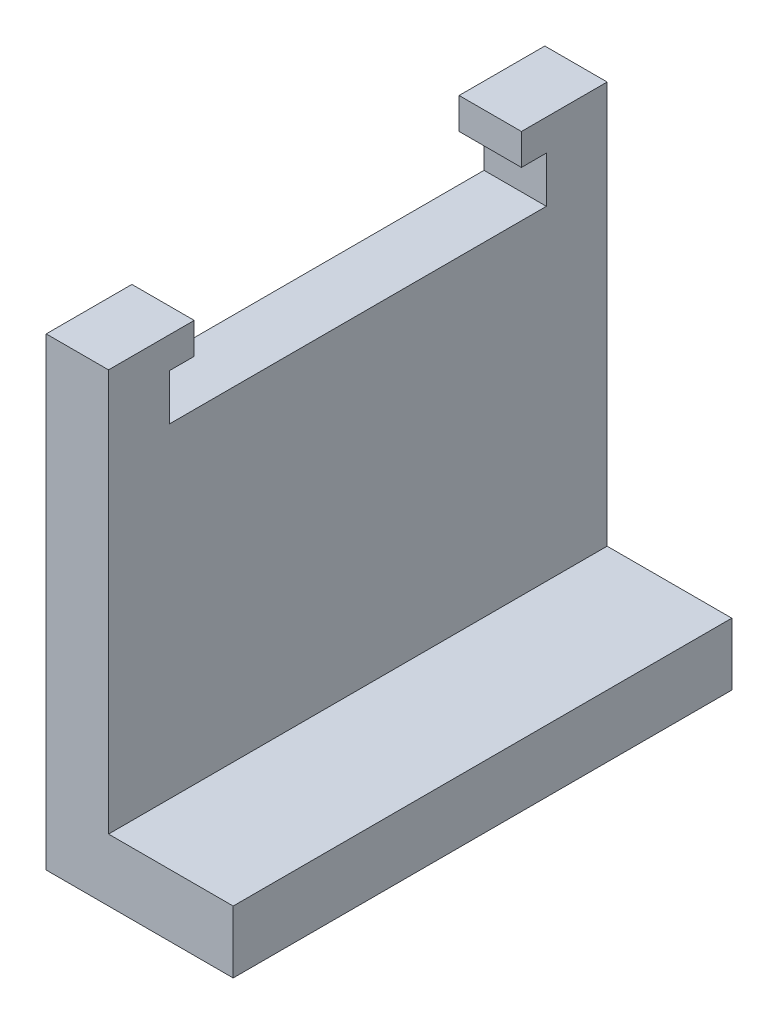
ISO-10303-21;
HEADER;
FILE_DESCRIPTION(('STEP AP214'),'2;1');
FILE_NAME('part.step','',(''),(''),'','','');
FILE_SCHEMA(('AUTOMOTIVE_DESIGN { 1 0 10303 214 1 1 1 1 }'));
ENDSEC;
DATA;
#1=APPLICATION_CONTEXT('core data for automotive mechanical design processes');
#2=APPLICATION_PROTOCOL_DEFINITION('international standard','automotive_design',2000,#1);
#3=PRODUCT_CONTEXT('',#1,'mechanical');
#4=PRODUCT('Part','Part','',(#3));
#5=PRODUCT_RELATED_PRODUCT_CATEGORY('part','',(#4));
#6=PRODUCT_DEFINITION_FORMATION('','',#4);
#7=PRODUCT_DEFINITION_CONTEXT('part definition',#1,'design');
#8=PRODUCT_DEFINITION('design','',#6,#7);
#9=PRODUCT_DEFINITION_SHAPE('','',#8);
#10=(LENGTH_UNIT() NAMED_UNIT(*) SI_UNIT(.MILLI.,.METRE.));
#11=(NAMED_UNIT(*) PLANE_ANGLE_UNIT() SI_UNIT($,.RADIAN.));
#12=(NAMED_UNIT(*) SI_UNIT($,.STERADIAN.) SOLID_ANGLE_UNIT());
#13=UNCERTAINTY_MEASURE_WITH_UNIT(LENGTH_MEASURE(1.E-05),#10,'distance_accuracy_value','');
#14=(GEOMETRIC_REPRESENTATION_CONTEXT(3) GLOBAL_UNCERTAINTY_ASSIGNED_CONTEXT((#13)) GLOBAL_UNIT_ASSIGNED_CONTEXT((#10,
#11,#12)) REPRESENTATION_CONTEXT('',''));
#15=CARTESIAN_POINT('',(0.,0.,0.));
#16=DIRECTION('',(0.,0.,1.));
#17=DIRECTION('',(1.,0.,0.));
#18=AXIS2_PLACEMENT_3D('',#15,#16,#17);
#19=CARTESIAN_POINT('',(10.,74.5,0.));
#20=DIRECTION('',(0.,0.,-1.));
#21=DIRECTION('',(-1.,0.,0.));
#22=AXIS2_PLACEMENT_3D('',#19,#20,#21);
#23=PLANE('',#22);
#24=DIRECTION('',(0.,-1.,0.));
#25=VECTOR('',#24,1.);
#26=CARTESIAN_POINT('',(0.,74.5,0.));
#27=LINE('',#26,#25);
#28=CARTESIAN_POINT('',(0.,74.5,0.));
#29=VERTEX_POINT('',#28);
#30=CARTESIAN_POINT('',(0.,0.,0.));
#31=VERTEX_POINT('',#30);
#32=EDGE_CURVE('E157',#29,#31,#27,.T.);
#33=ORIENTED_EDGE('',*,*,#32,.T.);
#34=DIRECTION('',(-1.,0.,0.));
#35=VECTOR('',#34,1.);
#36=CARTESIAN_POINT('',(10.,0.,0.));
#37=LINE('',#36,#35);
#38=CARTESIAN_POINT('',(30.,0.,0.));
#39=VERTEX_POINT('',#38);
#40=EDGE_CURVE('E11',#39,#31,#37,.T.);
#41=ORIENTED_EDGE('',*,*,#40,.F.);
#42=DIRECTION('',(0.,-1.,0.));
#43=VECTOR('',#42,1.);
#44=CARTESIAN_POINT('',(30.,0.,0.));
#45=LINE('',#44,#43);
#46=CARTESIAN_POINT('',(30.,10.,0.));
#47=VERTEX_POINT('',#46);
#48=EDGE_CURVE('E265',#47,#39,#45,.T.);
#49=ORIENTED_EDGE('',*,*,#48,.F.);
#50=DIRECTION('',(-1.,0.,0.));
#51=VECTOR('',#50,1.);
#52=CARTESIAN_POINT('',(30.,10.,0.));
#53=LINE('',#52,#51);
#54=CARTESIAN_POINT('',(10.,10.,0.));
#55=VERTEX_POINT('',#54);
#56=EDGE_CURVE('E257',#47,#55,#53,.T.);
#57=ORIENTED_EDGE('',*,*,#56,.T.);
#58=DIRECTION('',(0.,-1.,0.));
#59=VECTOR('',#58,1.);
#60=CARTESIAN_POINT('',(10.,74.5,0.));
#61=LINE('',#60,#59);
#62=CARTESIAN_POINT('',(10.,74.5,0.));
#63=VERTEX_POINT('',#62);
#64=EDGE_CURVE('E181',#63,#55,#61,.T.);
#65=ORIENTED_EDGE('',*,*,#64,.F.);
#66=DIRECTION('',(-1.,0.,0.));
#67=VECTOR('',#66,1.);
#68=CARTESIAN_POINT('',(10.,74.5,0.));
#69=LINE('',#68,#67);
#70=EDGE_CURVE('E153',#63,#29,#69,.T.);
#71=ORIENTED_EDGE('',*,*,#70,.T.);
#72=EDGE_LOOP('',(#33,#41,#49,#57,#65,#71));
#73=FACE_BOUND('',#72,.T.);
#74=ADVANCED_FACE('F35',(#73),#23,.F.);
#75=CARTESIAN_POINT('',(10.,0.,0.));
#76=DIRECTION('',(0.,1.,0.));
#77=DIRECTION('',(0.,0.,1.));
#78=AXIS2_PLACEMENT_3D('',#75,#76,#77);
#79=PLANE('',#78);
#80=DIRECTION('',(0.,0.,-1.));
#81=VECTOR('',#80,1.);
#82=CARTESIAN_POINT('',(0.,0.,0.));
#83=LINE('',#82,#81);
#84=CARTESIAN_POINT('',(0.,0.,-80.));
#85=VERTEX_POINT('',#84);
#86=EDGE_CURVE('E160',#31,#85,#83,.T.);
#87=ORIENTED_EDGE('',*,*,#86,.T.);
#88=DIRECTION('',(-1.,0.,0.));
#89=VECTOR('',#88,1.);
#90=CARTESIAN_POINT('',(10.,0.,-80.));
#91=LINE('',#90,#89);
#92=CARTESIAN_POINT('',(30.,0.,-80.));
#93=VERTEX_POINT('',#92);
#94=EDGE_CURVE('E42',#93,#85,#91,.T.);
#95=ORIENTED_EDGE('',*,*,#94,.F.);
#96=DIRECTION('',(0.,0.,-1.));
#97=VECTOR('',#96,1.);
#98=CARTESIAN_POINT('',(30.,0.,0.));
#99=LINE('',#98,#97);
#100=EDGE_CURVE('E269',#39,#93,#99,.T.);
#101=ORIENTED_EDGE('',*,*,#100,.F.);
#102=ORIENTED_EDGE('',*,*,#40,.T.);
#103=EDGE_LOOP('',(#87,#95,#101,#102));
#104=FACE_BOUND('',#103,.T.);
#105=ADVANCED_FACE('F293',(#104),#79,.F.);
#106=CARTESIAN_POINT('',(10.,0.,-80.));
#107=DIRECTION('',(0.,0.,1.));
#108=DIRECTION('',(0.,-1.,0.));
#109=AXIS2_PLACEMENT_3D('',#106,#107,#108);
#110=PLANE('',#109);
#111=DIRECTION('',(0.,1.,0.));
#112=VECTOR('',#111,1.);
#113=CARTESIAN_POINT('',(0.,0.,-80.));
#114=LINE('',#113,#112);
#115=CARTESIAN_POINT('',(0.,74.5,-80.));
#116=VERTEX_POINT('',#115);
#117=EDGE_CURVE('E163',#85,#116,#114,.T.);
#118=ORIENTED_EDGE('',*,*,#117,.T.);
#119=DIRECTION('',(-1.,0.,0.));
#120=VECTOR('',#119,1.);
#121=CARTESIAN_POINT('',(10.,74.5,-80.));
#122=LINE('',#121,#120);
#123=CARTESIAN_POINT('',(10.,74.5,-80.));
#124=VERTEX_POINT('',#123);
#125=EDGE_CURVE('E200',#124,#116,#122,.T.);
#126=ORIENTED_EDGE('',*,*,#125,.F.);
#127=DIRECTION('',(0.,1.,0.));
#128=VECTOR('',#127,1.);
#129=CARTESIAN_POINT('',(10.,0.,-80.));
#130=LINE('',#129,#128);
#131=CARTESIAN_POINT('',(10.,10.,-80.));
#132=VERTEX_POINT('',#131);
#133=EDGE_CURVE('E106',#132,#124,#130,.T.);
#134=ORIENTED_EDGE('',*,*,#133,.F.);
#135=DIRECTION('',(-1.,0.,0.));
#136=VECTOR('',#135,1.);
#137=CARTESIAN_POINT('',(30.,10.,-80.));
#138=LINE('',#137,#136);
#139=CARTESIAN_POINT('',(30.,10.,-80.));
#140=VERTEX_POINT('',#139);
#141=EDGE_CURVE('E161',#140,#132,#138,.T.);
#142=ORIENTED_EDGE('',*,*,#141,.F.);
#143=DIRECTION('',(0.,1.,0.));
#144=VECTOR('',#143,1.);
#145=CARTESIAN_POINT('',(30.,0.,-80.));
#146=LINE('',#145,#144);
#147=EDGE_CURVE('E211',#93,#140,#146,.T.);
#148=ORIENTED_EDGE('',*,*,#147,.F.);
#149=ORIENTED_EDGE('',*,*,#94,.T.);
#150=EDGE_LOOP('',(#118,#126,#134,#142,#148,#149));
#151=FACE_BOUND('',#150,.T.);
#152=ADVANCED_FACE('F207',(#151),#110,.F.);
#153=CARTESIAN_POINT('',(10.,74.5,-80.));
#154=DIRECTION('',(0.,-1.,0.));
#155=DIRECTION('',(0.,0.,-1.));
#156=AXIS2_PLACEMENT_3D('',#153,#154,#155);
#157=PLANE('',#156);
#158=DIRECTION('',(0.,0.,1.));
#159=VECTOR('',#158,1.);
#160=CARTESIAN_POINT('',(0.,74.5,-80.));
#161=LINE('',#160,#159);
#162=CARTESIAN_POINT('',(0.,74.5,-66.25));
#163=VERTEX_POINT('',#162);
#164=EDGE_CURVE('E165',#116,#163,#161,.T.);
#165=ORIENTED_EDGE('',*,*,#164,.T.);
#166=DIRECTION('',(-1.,0.,0.));
#167=VECTOR('',#166,1.);
#168=CARTESIAN_POINT('',(10.,74.5,-66.25));
#169=LINE('',#168,#167);
#170=CARTESIAN_POINT('',(10.,74.5,-66.25));
#171=VERTEX_POINT('',#170);
#172=EDGE_CURVE('E197',#171,#163,#169,.T.);
#173=ORIENTED_EDGE('',*,*,#172,.F.);
#174=DIRECTION('',(0.,0.,1.));
#175=VECTOR('',#174,1.);
#176=CARTESIAN_POINT('',(10.,74.5,-80.));
#177=LINE('',#176,#175);
#178=EDGE_CURVE('E232',#124,#171,#177,.T.);
#179=ORIENTED_EDGE('',*,*,#178,.F.);
#180=ORIENTED_EDGE('',*,*,#125,.T.);
#181=EDGE_LOOP('',(#165,#173,#179,#180));
#182=FACE_BOUND('',#181,.T.);
#183=ADVANCED_FACE('F223',(#182),#157,.F.);
#184=CARTESIAN_POINT('',(10.,74.5,-66.25));
#185=DIRECTION('',(0.,0.,-1.));
#186=DIRECTION('',(-1.,0.,0.));
#187=AXIS2_PLACEMENT_3D('',#184,#185,#186);
#188=PLANE('',#187);
#189=DIRECTION('',(0.,-1.,0.));
#190=VECTOR('',#189,1.);
#191=CARTESIAN_POINT('',(0.,74.5,-66.25));
#192=LINE('',#191,#190);
#193=CARTESIAN_POINT('',(0.,69.5,-66.25));
#194=VERTEX_POINT('',#193);
#195=EDGE_CURVE('E167',#163,#194,#192,.T.);
#196=ORIENTED_EDGE('',*,*,#195,.T.);
#197=DIRECTION('',(-1.,0.,0.));
#198=VECTOR('',#197,1.);
#199=CARTESIAN_POINT('',(10.,69.5,-66.25));
#200=LINE('',#199,#198);
#201=CARTESIAN_POINT('',(10.,69.5,-66.25));
#202=VERTEX_POINT('',#201);
#203=EDGE_CURVE('E194',#202,#194,#200,.T.);
#204=ORIENTED_EDGE('',*,*,#203,.F.);
#205=DIRECTION('',(0.,-1.,0.));
#206=VECTOR('',#205,1.);
#207=CARTESIAN_POINT('',(10.,74.5,-66.25));
#208=LINE('',#207,#206);
#209=EDGE_CURVE('E229',#171,#202,#208,.T.);
#210=ORIENTED_EDGE('',*,*,#209,.F.);
#211=ORIENTED_EDGE('',*,*,#172,.T.);
#212=EDGE_LOOP('',(#196,#204,#210,#211));
#213=FACE_BOUND('',#212,.T.);
#214=ADVANCED_FACE('F227',(#213),#188,.F.);
#215=CARTESIAN_POINT('',(10.,69.5,-66.25));
#216=DIRECTION('',(0.,1.,0.));
#217=DIRECTION('',(0.,0.,1.));
#218=AXIS2_PLACEMENT_3D('',#215,#216,#217);
#219=PLANE('',#218);
#220=DIRECTION('',(0.,0.,-1.));
#221=VECTOR('',#220,1.);
#222=CARTESIAN_POINT('',(0.,69.5,-66.25));
#223=LINE('',#222,#221);
#224=CARTESIAN_POINT('',(0.,69.5,-70.25));
#225=VERTEX_POINT('',#224);
#226=EDGE_CURVE('E169',#194,#225,#223,.T.);
#227=ORIENTED_EDGE('',*,*,#226,.T.);
#228=DIRECTION('',(-1.,0.,0.));
#229=VECTOR('',#228,1.);
#230=CARTESIAN_POINT('',(10.,69.5,-70.25));
#231=LINE('',#230,#229);
#232=CARTESIAN_POINT('',(10.,69.5,-70.25));
#233=VERTEX_POINT('',#232);
#234=EDGE_CURVE('E191',#233,#225,#231,.T.);
#235=ORIENTED_EDGE('',*,*,#234,.F.);
#236=DIRECTION('',(0.,0.,-1.));
#237=VECTOR('',#236,1.);
#238=CARTESIAN_POINT('',(10.,69.5,-66.25));
#239=LINE('',#238,#237);
#240=EDGE_CURVE('E231',#202,#233,#239,.T.);
#241=ORIENTED_EDGE('',*,*,#240,.F.);
#242=ORIENTED_EDGE('',*,*,#203,.T.);
#243=EDGE_LOOP('',(#227,#235,#241,#242));
#244=FACE_BOUND('',#243,.T.);
#245=ADVANCED_FACE('F306',(#244),#219,.F.);
#246=CARTESIAN_POINT('',(10.,69.5,-70.25));
#247=DIRECTION('',(0.,0.,-1.));
#248=DIRECTION('',(-1.,0.,0.));
#249=AXIS2_PLACEMENT_3D('',#246,#247,#248);
#250=PLANE('',#249);
#251=DIRECTION('',(0.,-1.,0.));
#252=VECTOR('',#251,1.);
#253=CARTESIAN_POINT('',(0.,69.5,-70.25));
#254=LINE('',#253,#252);
#255=CARTESIAN_POINT('',(0.,62.1,-70.25));
#256=VERTEX_POINT('',#255);
#257=EDGE_CURVE('E171',#225,#256,#254,.T.);
#258=ORIENTED_EDGE('',*,*,#257,.T.);
#259=DIRECTION('',(-1.,0.,0.));
#260=VECTOR('',#259,1.);
#261=CARTESIAN_POINT('',(10.,62.1,-70.25));
#262=LINE('',#261,#260);
#263=CARTESIAN_POINT('',(10.,62.1,-70.25));
#264=VERTEX_POINT('',#263);
#265=EDGE_CURVE('E188',#264,#256,#262,.T.);
#266=ORIENTED_EDGE('',*,*,#265,.F.);
#267=DIRECTION('',(0.,-1.,0.));
#268=VECTOR('',#267,1.);
#269=CARTESIAN_POINT('',(10.,69.5,-70.25));
#270=LINE('',#269,#268);
#271=EDGE_CURVE('E234',#233,#264,#270,.T.);
#272=ORIENTED_EDGE('',*,*,#271,.F.);
#273=ORIENTED_EDGE('',*,*,#234,.T.);
#274=EDGE_LOOP('',(#258,#266,#272,#273));
#275=FACE_BOUND('',#274,.T.);
#276=ADVANCED_FACE('F309',(#275),#250,.F.);
#277=CARTESIAN_POINT('',(10.,62.1,-70.25));
#278=DIRECTION('',(0.,-1.,0.));
#279=DIRECTION('',(0.,0.,-1.));
#280=AXIS2_PLACEMENT_3D('',#277,#278,#279);
#281=PLANE('',#280);
#282=DIRECTION('',(0.,0.,1.));
#283=VECTOR('',#282,1.);
#284=CARTESIAN_POINT('',(0.,62.1,-70.25));
#285=LINE('',#284,#283);
#286=CARTESIAN_POINT('',(0.,62.1,-9.74999999999998));
#287=VERTEX_POINT('',#286);
#288=EDGE_CURVE('E173',#256,#287,#285,.T.);
#289=ORIENTED_EDGE('',*,*,#288,.T.);
#290=DIRECTION('',(-1.,0.,0.));
#291=VECTOR('',#290,1.);
#292=CARTESIAN_POINT('',(10.,62.1,-9.74999999999998));
#293=LINE('',#292,#291);
#294=CARTESIAN_POINT('',(10.,62.1,-9.74999999999998));
#295=VERTEX_POINT('',#294);
#296=EDGE_CURVE('E185',#295,#287,#293,.T.);
#297=ORIENTED_EDGE('',*,*,#296,.F.);
#298=DIRECTION('',(0.,0.,1.));
#299=VECTOR('',#298,1.);
#300=CARTESIAN_POINT('',(10.,62.1,-70.25));
#301=LINE('',#300,#299);
#302=EDGE_CURVE('E240',#264,#295,#301,.T.);
#303=ORIENTED_EDGE('',*,*,#302,.F.);
#304=ORIENTED_EDGE('',*,*,#265,.T.);
#305=EDGE_LOOP('',(#289,#297,#303,#304));
#306=FACE_BOUND('',#305,.T.);
#307=ADVANCED_FACE('F246',(#306),#281,.F.);
#308=CARTESIAN_POINT('',(10.,62.1,-9.74999999999998));
#309=DIRECTION('',(0.,0.,1.));
#310=DIRECTION('',(0.,-1.,0.));
#311=AXIS2_PLACEMENT_3D('',#308,#309,#310);
#312=PLANE('',#311);
#313=DIRECTION('',(0.,1.,0.));
#314=VECTOR('',#313,1.);
#315=CARTESIAN_POINT('',(0.,62.1,-9.74999999999998));
#316=LINE('',#315,#314);
#317=CARTESIAN_POINT('',(0.,69.5,-9.74999999999998));
#318=VERTEX_POINT('',#317);
#319=EDGE_CURVE('E175',#287,#318,#316,.T.);
#320=ORIENTED_EDGE('',*,*,#319,.T.);
#321=DIRECTION('',(-1.,0.,0.));
#322=VECTOR('',#321,1.);
#323=CARTESIAN_POINT('',(10.,69.5,-9.74999999999998));
#324=LINE('',#323,#322);
#325=CARTESIAN_POINT('',(10.,69.5,-9.74999999999998));
#326=VERTEX_POINT('',#325);
#327=EDGE_CURVE('E148',#326,#318,#324,.T.);
#328=ORIENTED_EDGE('',*,*,#327,.F.);
#329=DIRECTION('',(0.,1.,0.));
#330=VECTOR('',#329,1.);
#331=CARTESIAN_POINT('',(10.,62.1,-9.74999999999998));
#332=LINE('',#331,#330);
#333=EDGE_CURVE('E136',#295,#326,#332,.T.);
#334=ORIENTED_EDGE('',*,*,#333,.F.);
#335=ORIENTED_EDGE('',*,*,#296,.T.);
#336=EDGE_LOOP('',(#320,#328,#334,#335));
#337=FACE_BOUND('',#336,.T.);
#338=ADVANCED_FACE('F250',(#337),#312,.F.);
#339=CARTESIAN_POINT('',(10.,69.5,-9.74999999999998));
#340=DIRECTION('',(0.,1.,0.));
#341=DIRECTION('',(0.,0.,1.));
#342=AXIS2_PLACEMENT_3D('',#339,#340,#341);
#343=PLANE('',#342);
#344=DIRECTION('',(0.,0.,-1.));
#345=VECTOR('',#344,1.);
#346=CARTESIAN_POINT('',(0.,69.5,-9.74999999999998));
#347=LINE('',#346,#345);
#348=CARTESIAN_POINT('',(0.,69.5,-13.75));
#349=VERTEX_POINT('',#348);
#350=EDGE_CURVE('E145',#318,#349,#347,.T.);
#351=ORIENTED_EDGE('',*,*,#350,.T.);
#352=DIRECTION('',(-1.,0.,0.));
#353=VECTOR('',#352,1.);
#354=CARTESIAN_POINT('',(10.,69.5,-13.75));
#355=LINE('',#354,#353);
#356=CARTESIAN_POINT('',(10.,69.5,-13.75));
#357=VERTEX_POINT('',#356);
#358=EDGE_CURVE('E142',#357,#349,#355,.T.);
#359=ORIENTED_EDGE('',*,*,#358,.F.);
#360=DIRECTION('',(0.,0.,-1.));
#361=VECTOR('',#360,1.);
#362=CARTESIAN_POINT('',(10.,69.5,-9.74999999999998));
#363=LINE('',#362,#361);
#364=EDGE_CURVE('E129',#326,#357,#363,.T.);
#365=ORIENTED_EDGE('',*,*,#364,.F.);
#366=ORIENTED_EDGE('',*,*,#327,.T.);
#367=EDGE_LOOP('',(#351,#359,#365,#366));
#368=FACE_BOUND('',#367,.T.);
#369=ADVANCED_FACE('F143',(#368),#343,.F.);
#370=CARTESIAN_POINT('',(10.,69.5,-13.75));
#371=DIRECTION('',(0.,0.,1.));
#372=DIRECTION('',(1.,0.,0.));
#373=AXIS2_PLACEMENT_3D('',#370,#371,#372);
#374=PLANE('',#373);
#375=DIRECTION('',(0.,1.,0.));
#376=VECTOR('',#375,1.);
#377=CARTESIAN_POINT('',(0.,69.5,-13.75));
#378=LINE('',#377,#376);
#379=CARTESIAN_POINT('',(0.,74.5,-13.75));
#380=VERTEX_POINT('',#379);
#381=EDGE_CURVE('E178',#349,#380,#378,.T.);
#382=ORIENTED_EDGE('',*,*,#381,.T.);
#383=DIRECTION('',(-1.,0.,0.));
#384=VECTOR('',#383,1.);
#385=CARTESIAN_POINT('',(10.,74.5,-13.75));
#386=LINE('',#385,#384);
#387=CARTESIAN_POINT('',(10.,74.5,-13.75));
#388=VERTEX_POINT('',#387);
#389=EDGE_CURVE('E149',#388,#380,#386,.T.);
#390=ORIENTED_EDGE('',*,*,#389,.F.);
#391=DIRECTION('',(0.,1.,0.));
#392=VECTOR('',#391,1.);
#393=CARTESIAN_POINT('',(10.,69.5,-13.75));
#394=LINE('',#393,#392);
#395=EDGE_CURVE('E133',#357,#388,#394,.T.);
#396=ORIENTED_EDGE('',*,*,#395,.F.);
#397=ORIENTED_EDGE('',*,*,#358,.T.);
#398=EDGE_LOOP('',(#382,#390,#396,#397));
#399=FACE_BOUND('',#398,.T.);
#400=ADVANCED_FACE('F151',(#399),#374,.F.);
#401=CARTESIAN_POINT('',(10.,74.5,-13.75));
#402=DIRECTION('',(0.,-1.,0.));
#403=DIRECTION('',(0.,0.,-1.));
#404=AXIS2_PLACEMENT_3D('',#401,#402,#403);
#405=PLANE('',#404);
#406=DIRECTION('',(0.,0.,1.));
#407=VECTOR('',#406,1.);
#408=CARTESIAN_POINT('',(0.,74.5,-13.75));
#409=LINE('',#408,#407);
#410=EDGE_CURVE('E101',#380,#29,#409,.T.);
#411=ORIENTED_EDGE('',*,*,#410,.T.);
#412=ORIENTED_EDGE('',*,*,#70,.F.);
#413=DIRECTION('',(0.,0.,1.));
#414=VECTOR('',#413,1.);
#415=CARTESIAN_POINT('',(10.,74.5,-13.75));
#416=LINE('',#415,#414);
#417=EDGE_CURVE('E56',#388,#63,#416,.T.);
#418=ORIENTED_EDGE('',*,*,#417,.F.);
#419=ORIENTED_EDGE('',*,*,#389,.T.);
#420=EDGE_LOOP('',(#411,#412,#418,#419));
#421=FACE_BOUND('',#420,.T.);
#422=ADVANCED_FACE('F251',(#421),#405,.F.);
#423=CARTESIAN_POINT('',(10.,0.,0.));
#424=DIRECTION('',(1.,0.,0.));
#425=DIRECTION('',(0.,0.,-1.));
#426=AXIS2_PLACEMENT_3D('',#423,#424,#425);
#427=PLANE('',#426);
#428=DIRECTION('',(0.,0.,1.));
#429=VECTOR('',#428,1.);
#430=CARTESIAN_POINT('',(10.,10.,0.));
#431=LINE('',#430,#429);
#432=EDGE_CURVE('E49',#132,#55,#431,.T.);
#433=ORIENTED_EDGE('',*,*,#432,.F.);
#434=ORIENTED_EDGE('',*,*,#133,.T.);
#435=ORIENTED_EDGE('',*,*,#178,.T.);
#436=ORIENTED_EDGE('',*,*,#209,.T.);
#437=ORIENTED_EDGE('',*,*,#240,.T.);
#438=ORIENTED_EDGE('',*,*,#271,.T.);
#439=ORIENTED_EDGE('',*,*,#302,.T.);
#440=ORIENTED_EDGE('',*,*,#333,.T.);
#441=ORIENTED_EDGE('',*,*,#364,.T.);
#442=ORIENTED_EDGE('',*,*,#395,.T.);
#443=ORIENTED_EDGE('',*,*,#417,.T.);
#444=ORIENTED_EDGE('',*,*,#64,.T.);
#445=EDGE_LOOP('',(#433,#434,#435,#436,#437,#438,#439,#440,#441,#442,#443,#444));
#446=FACE_BOUND('',#445,.T.);
#447=ADVANCED_FACE('F131',(#446),#427,.T.);
#448=CARTESIAN_POINT('',(0.,0.,0.));
#449=DIRECTION('',(1.,0.,0.));
#450=DIRECTION('',(0.,0.,-1.));
#451=AXIS2_PLACEMENT_3D('',#448,#449,#450);
#452=PLANE('',#451);
#453=ORIENTED_EDGE('',*,*,#32,.F.);
#454=ORIENTED_EDGE('',*,*,#410,.F.);
#455=ORIENTED_EDGE('',*,*,#381,.F.);
#456=ORIENTED_EDGE('',*,*,#350,.F.);
#457=ORIENTED_EDGE('',*,*,#319,.F.);
#458=ORIENTED_EDGE('',*,*,#288,.F.);
#459=ORIENTED_EDGE('',*,*,#257,.F.);
#460=ORIENTED_EDGE('',*,*,#226,.F.);
#461=ORIENTED_EDGE('',*,*,#195,.F.);
#462=ORIENTED_EDGE('',*,*,#164,.F.);
#463=ORIENTED_EDGE('',*,*,#117,.F.);
#464=ORIENTED_EDGE('',*,*,#86,.F.);
#465=EDGE_LOOP('',(#453,#454,#455,#456,#457,#458,#459,#460,#461,#462,#463,#464));
#466=FACE_BOUND('',#465,.T.);
#467=ADVANCED_FACE('F218',(#466),#452,.F.);
#468=CARTESIAN_POINT('',(30.,10.,0.));
#469=DIRECTION('',(0.,-1.,0.));
#470=DIRECTION('',(0.,0.,-1.));
#471=AXIS2_PLACEMENT_3D('',#468,#469,#470);
#472=PLANE('',#471);
#473=ORIENTED_EDGE('',*,*,#432,.T.);
#474=ORIENTED_EDGE('',*,*,#56,.F.);
#475=DIRECTION('',(0.,0.,1.));
#476=VECTOR('',#475,1.);
#477=CARTESIAN_POINT('',(30.,10.,0.));
#478=LINE('',#477,#476);
#479=EDGE_CURVE('E263',#140,#47,#478,.T.);
#480=ORIENTED_EDGE('',*,*,#479,.F.);
#481=ORIENTED_EDGE('',*,*,#141,.T.);
#482=EDGE_LOOP('',(#473,#474,#480,#481));
#483=FACE_BOUND('',#482,.T.);
#484=ADVANCED_FACE('F282',(#483),#472,.F.);
#485=CARTESIAN_POINT('',(30.,0.,0.));
#486=DIRECTION('',(-1.,0.,0.));
#487=DIRECTION('',(0.,0.,1.));
#488=AXIS2_PLACEMENT_3D('',#485,#486,#487);
#489=PLANE('',#488);
#490=ORIENTED_EDGE('',*,*,#48,.T.);
#491=ORIENTED_EDGE('',*,*,#100,.T.);
#492=ORIENTED_EDGE('',*,*,#147,.T.);
#493=ORIENTED_EDGE('',*,*,#479,.T.);
#494=EDGE_LOOP('',(#490,#491,#492,#493));
#495=FACE_BOUND('',#494,.T.);
#496=ADVANCED_FACE('F274',(#495),#489,.F.);
#497=CLOSED_SHELL('',(#74,#105,#152,#183,#214,#245,#276,#307,#338,#369,#400,#422,#447,#467,#484,#496));
#498=MANIFOLD_SOLID_BREP('B2',#497);
#499=ADVANCED_BREP_SHAPE_REPRESENTATION('',(#18,#498),#14);
#500=SHAPE_DEFINITION_REPRESENTATION(#9,#499);
ENDSEC;
END-ISO-10303-21;
